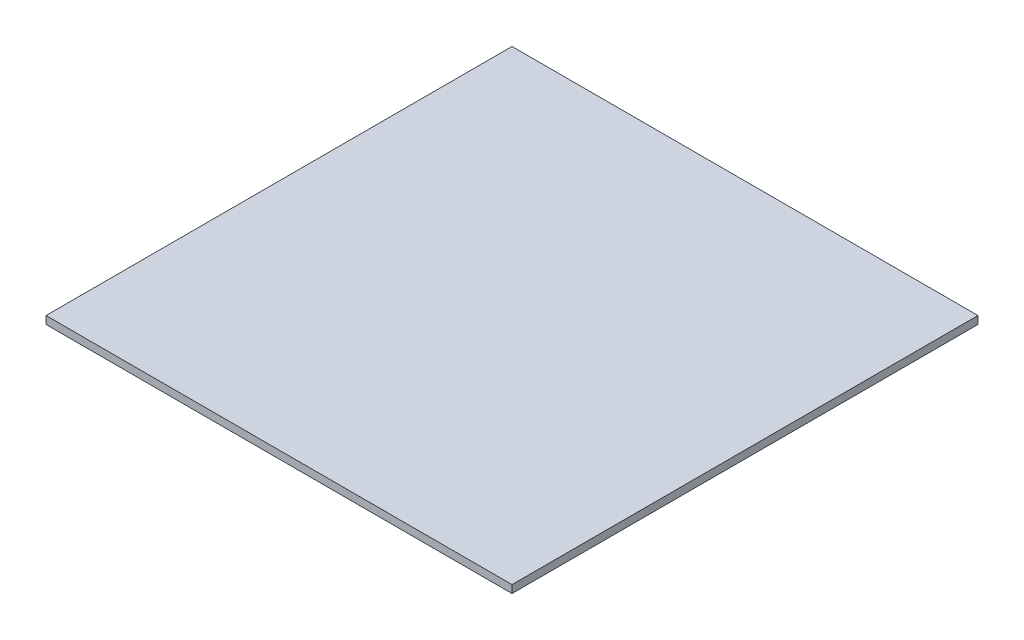
ISO-10303-21;
HEADER;
FILE_DESCRIPTION(('STEP AP214'),'2;1');
FILE_NAME('part.step','',(''),(''),'','','');
FILE_SCHEMA(('AUTOMOTIVE_DESIGN { 1 0 10303 214 1 1 1 1 }'));
ENDSEC;
DATA;
#1=APPLICATION_CONTEXT('core data for automotive mechanical design processes');
#2=APPLICATION_PROTOCOL_DEFINITION('international standard','automotive_design',2000,#1);
#3=PRODUCT_CONTEXT('',#1,'mechanical');
#4=PRODUCT('Part','Part','',(#3));
#5=PRODUCT_RELATED_PRODUCT_CATEGORY('part','',(#4));
#6=PRODUCT_DEFINITION_FORMATION('','',#4);
#7=PRODUCT_DEFINITION_CONTEXT('part definition',#1,'design');
#8=PRODUCT_DEFINITION('design','',#6,#7);
#9=PRODUCT_DEFINITION_SHAPE('','',#8);
#10=(LENGTH_UNIT() NAMED_UNIT(*) SI_UNIT(.MILLI.,.METRE.));
#11=(NAMED_UNIT(*) PLANE_ANGLE_UNIT() SI_UNIT($,.RADIAN.));
#12=(NAMED_UNIT(*) SI_UNIT($,.STERADIAN.) SOLID_ANGLE_UNIT());
#13=UNCERTAINTY_MEASURE_WITH_UNIT(LENGTH_MEASURE(1.E-05),#10,'distance_accuracy_value','');
#14=(GEOMETRIC_REPRESENTATION_CONTEXT(3) GLOBAL_UNCERTAINTY_ASSIGNED_CONTEXT((#13)) GLOBAL_UNIT_ASSIGNED_CONTEXT((#10,
#11,#12)) REPRESENTATION_CONTEXT('',''));
#15=CARTESIAN_POINT('',(0.,0.,0.));
#16=DIRECTION('',(0.,0.,1.));
#17=DIRECTION('',(1.,0.,0.));
#18=AXIS2_PLACEMENT_3D('',#15,#16,#17);
#19=CARTESIAN_POINT('',(762.,25.4,-762.));
#20=DIRECTION('',(-1.,0.,0.));
#21=DIRECTION('',(0.,0.,1.));
#22=AXIS2_PLACEMENT_3D('',#19,#20,#21);
#23=PLANE('',#22);
#24=DIRECTION('',(0.,0.,-1.));
#25=VECTOR('',#24,1.);
#26=CARTESIAN_POINT('',(762.,0.,-762.));
#27=LINE('',#26,#25);
#28=CARTESIAN_POINT('',(762.,0.,762.));
#29=VERTEX_POINT('',#28);
#30=CARTESIAN_POINT('',(762.,0.,-762.));
#31=VERTEX_POINT('',#30);
#32=EDGE_CURVE('E96',#29,#31,#27,.T.);
#33=ORIENTED_EDGE('',*,*,#32,.T.);
#34=DIRECTION('',(0.,-1.,0.));
#35=VECTOR('',#34,1.);
#36=CARTESIAN_POINT('',(762.,25.4,-762.));
#37=LINE('',#36,#35);
#38=CARTESIAN_POINT('',(762.,25.4,-762.));
#39=VERTEX_POINT('',#38);
#40=EDGE_CURVE('E11',#39,#31,#37,.T.);
#41=ORIENTED_EDGE('',*,*,#40,.F.);
#42=DIRECTION('',(0.,0.,-1.));
#43=VECTOR('',#42,1.);
#44=CARTESIAN_POINT('',(762.,25.4,-762.));
#45=LINE('',#44,#43);
#46=CARTESIAN_POINT('',(762.,25.4,762.));
#47=VERTEX_POINT('',#46);
#48=EDGE_CURVE('E84',#47,#39,#45,.T.);
#49=ORIENTED_EDGE('',*,*,#48,.F.);
#50=DIRECTION('',(0.,-1.,0.));
#51=VECTOR('',#50,1.);
#52=CARTESIAN_POINT('',(762.,25.4,762.));
#53=LINE('',#52,#51);
#54=EDGE_CURVE('E92',#47,#29,#53,.T.);
#55=ORIENTED_EDGE('',*,*,#54,.T.);
#56=EDGE_LOOP('',(#33,#41,#49,#55));
#57=FACE_BOUND('',#56,.T.);
#58=ADVANCED_FACE('F33',(#57),#23,.F.);
#59=CARTESIAN_POINT('',(-762.,25.4,-762.));
#60=DIRECTION('',(0.,0.,1.));
#61=DIRECTION('',(1.,0.,0.));
#62=AXIS2_PLACEMENT_3D('',#59,#60,#61);
#63=PLANE('',#62);
#64=DIRECTION('',(-1.,0.,0.));
#65=VECTOR('',#64,1.);
#66=CARTESIAN_POINT('',(-762.,0.,-762.));
#67=LINE('',#66,#65);
#68=CARTESIAN_POINT('',(-762.,0.,-762.));
#69=VERTEX_POINT('',#68);
#70=EDGE_CURVE('E88',#31,#69,#67,.T.);
#71=ORIENTED_EDGE('',*,*,#70,.T.);
#72=DIRECTION('',(0.,-1.,0.));
#73=VECTOR('',#72,1.);
#74=CARTESIAN_POINT('',(-762.,25.4,-762.));
#75=LINE('',#74,#73);
#76=CARTESIAN_POINT('',(-762.,25.4,-762.));
#77=VERTEX_POINT('',#76);
#78=EDGE_CURVE('E41',#77,#69,#75,.T.);
#79=ORIENTED_EDGE('',*,*,#78,.F.);
#80=DIRECTION('',(-1.,0.,0.));
#81=VECTOR('',#80,1.);
#82=CARTESIAN_POINT('',(-762.,25.4,-762.));
#83=LINE('',#82,#81);
#84=EDGE_CURVE('E79',#39,#77,#83,.T.);
#85=ORIENTED_EDGE('',*,*,#84,.F.);
#86=ORIENTED_EDGE('',*,*,#40,.T.);
#87=EDGE_LOOP('',(#71,#79,#85,#86));
#88=FACE_BOUND('',#87,.T.);
#89=ADVANCED_FACE('F87',(#88),#63,.F.);
#90=CARTESIAN_POINT('',(-762.,25.4,-762.));
#91=DIRECTION('',(1.,0.,0.));
#92=DIRECTION('',(0.,0.,-1.));
#93=AXIS2_PLACEMENT_3D('',#90,#91,#92);
#94=PLANE('',#93);
#95=DIRECTION('',(0.,0.,1.));
#96=VECTOR('',#95,1.);
#97=CARTESIAN_POINT('',(-762.,0.,-762.));
#98=LINE('',#97,#96);
#99=CARTESIAN_POINT('',(-762.,0.,762.));
#100=VERTEX_POINT('',#99);
#101=EDGE_CURVE('E66',#69,#100,#98,.T.);
#102=ORIENTED_EDGE('',*,*,#101,.T.);
#103=DIRECTION('',(0.,-1.,0.));
#104=VECTOR('',#103,1.);
#105=CARTESIAN_POINT('',(-762.,25.4,762.));
#106=LINE('',#105,#104);
#107=CARTESIAN_POINT('',(-762.,25.4,762.));
#108=VERTEX_POINT('',#107);
#109=EDGE_CURVE('E89',#108,#100,#106,.T.);
#110=ORIENTED_EDGE('',*,*,#109,.F.);
#111=DIRECTION('',(0.,0.,1.));
#112=VECTOR('',#111,1.);
#113=CARTESIAN_POINT('',(-762.,25.4,-762.));
#114=LINE('',#113,#112);
#115=EDGE_CURVE('E82',#77,#108,#114,.T.);
#116=ORIENTED_EDGE('',*,*,#115,.F.);
#117=ORIENTED_EDGE('',*,*,#78,.T.);
#118=EDGE_LOOP('',(#102,#110,#116,#117));
#119=FACE_BOUND('',#118,.T.);
#120=ADVANCED_FACE('F90',(#119),#94,.F.);
#121=CARTESIAN_POINT('',(-762.,25.4,762.));
#122=DIRECTION('',(0.,0.,-1.));
#123=DIRECTION('',(-1.,0.,0.));
#124=AXIS2_PLACEMENT_3D('',#121,#122,#123);
#125=PLANE('',#124);
#126=DIRECTION('',(1.,0.,0.));
#127=VECTOR('',#126,1.);
#128=CARTESIAN_POINT('',(-762.,0.,762.));
#129=LINE('',#128,#127);
#130=EDGE_CURVE('E72',#100,#29,#129,.T.);
#131=ORIENTED_EDGE('',*,*,#130,.T.);
#132=ORIENTED_EDGE('',*,*,#54,.F.);
#133=DIRECTION('',(1.,0.,0.));
#134=VECTOR('',#133,1.);
#135=CARTESIAN_POINT('',(-762.,25.4,762.));
#136=LINE('',#135,#134);
#137=EDGE_CURVE('E49',#108,#47,#136,.T.);
#138=ORIENTED_EDGE('',*,*,#137,.F.);
#139=ORIENTED_EDGE('',*,*,#109,.T.);
#140=EDGE_LOOP('',(#131,#132,#138,#139));
#141=FACE_BOUND('',#140,.T.);
#142=ADVANCED_FACE('F103',(#141),#125,.F.);
#143=CARTESIAN_POINT('',(0.,25.4,0.));
#144=DIRECTION('',(0.,1.,0.));
#145=DIRECTION('',(0.,0.,1.));
#146=AXIS2_PLACEMENT_3D('',#143,#144,#145);
#147=PLANE('',#146);
#148=ORIENTED_EDGE('',*,*,#48,.T.);
#149=ORIENTED_EDGE('',*,*,#84,.T.);
#150=ORIENTED_EDGE('',*,*,#115,.T.);
#151=ORIENTED_EDGE('',*,*,#137,.T.);
#152=EDGE_LOOP('',(#148,#149,#150,#151));
#153=FACE_BOUND('',#152,.T.);
#154=ADVANCED_FACE('F80',(#153),#147,.T.);
#155=CARTESIAN_POINT('',(0.,0.,0.));
#156=DIRECTION('',(0.,1.,0.));
#157=DIRECTION('',(0.,0.,1.));
#158=AXIS2_PLACEMENT_3D('',#155,#156,#157);
#159=PLANE('',#158);
#160=ORIENTED_EDGE('',*,*,#32,.F.);
#161=ORIENTED_EDGE('',*,*,#130,.F.);
#162=ORIENTED_EDGE('',*,*,#101,.F.);
#163=ORIENTED_EDGE('',*,*,#70,.F.);
#164=EDGE_LOOP('',(#160,#161,#162,#163));
#165=FACE_BOUND('',#164,.T.);
#166=ADVANCED_FACE('F106',(#165),#159,.F.);
#167=CLOSED_SHELL('',(#58,#89,#120,#142,#154,#166));
#168=MANIFOLD_SOLID_BREP('B2',#167);
#169=ADVANCED_BREP_SHAPE_REPRESENTATION('',(#18,#168),#14);
#170=SHAPE_DEFINITION_REPRESENTATION(#9,#169);
ENDSEC;
END-ISO-10303-21;
